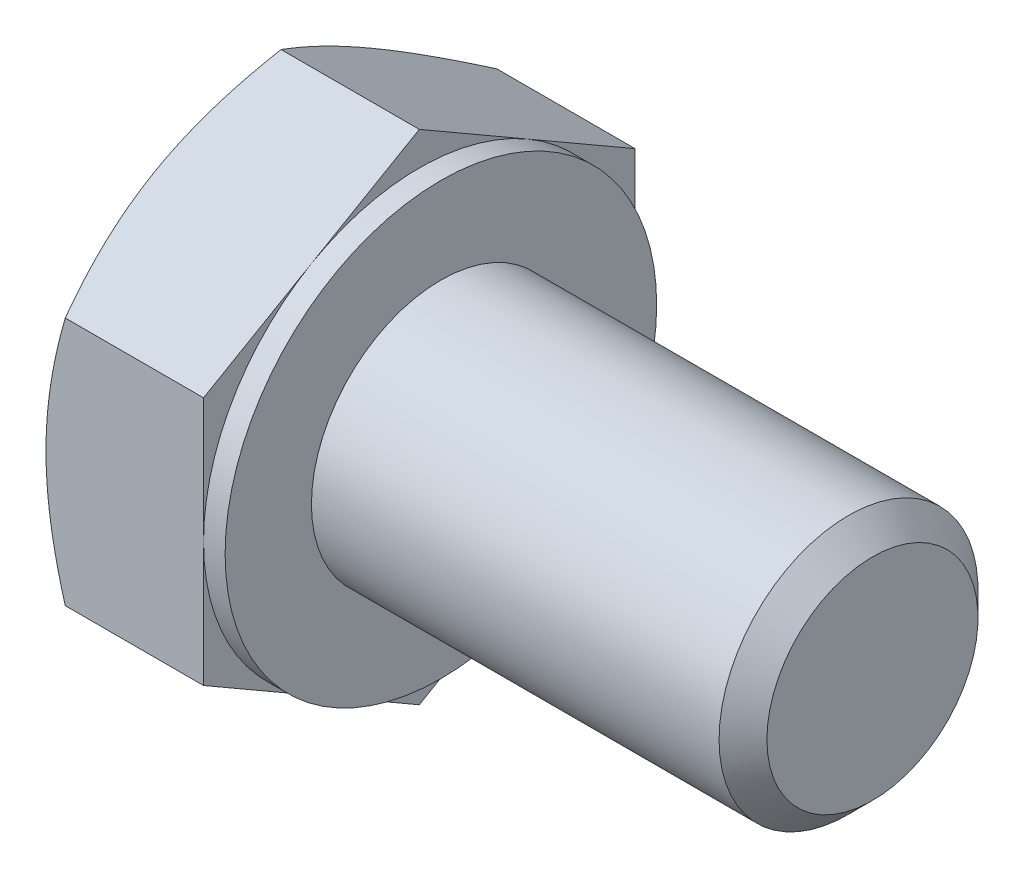
ISO-10303-21;
HEADER;
FILE_DESCRIPTION(('STEP AP214'),'2;1');
FILE_NAME('part.step','',(''),(''),'','','');
FILE_SCHEMA(('AUTOMOTIVE_DESIGN { 1 0 10303 214 1 1 1 1 }'));
ENDSEC;
DATA;
#1=APPLICATION_CONTEXT('core data for automotive mechanical design processes');
#2=APPLICATION_PROTOCOL_DEFINITION('international standard','automotive_design',2000,#1);
#3=PRODUCT_CONTEXT('',#1,'mechanical');
#4=PRODUCT('Part','Part','',(#3));
#5=PRODUCT_RELATED_PRODUCT_CATEGORY('part','',(#4));
#6=PRODUCT_DEFINITION_FORMATION('','',#4);
#7=PRODUCT_DEFINITION_CONTEXT('part definition',#1,'design');
#8=PRODUCT_DEFINITION('design','',#6,#7);
#9=PRODUCT_DEFINITION_SHAPE('','',#8);
#10=(LENGTH_UNIT() NAMED_UNIT(*) SI_UNIT(.MILLI.,.METRE.));
#11=(NAMED_UNIT(*) PLANE_ANGLE_UNIT() SI_UNIT($,.RADIAN.));
#12=(NAMED_UNIT(*) SI_UNIT($,.STERADIAN.) SOLID_ANGLE_UNIT());
#13=UNCERTAINTY_MEASURE_WITH_UNIT(LENGTH_MEASURE(1.E-05),#10,'distance_accuracy_value','');
#14=(GEOMETRIC_REPRESENTATION_CONTEXT(3) GLOBAL_UNCERTAINTY_ASSIGNED_CONTEXT((#13)) GLOBAL_UNIT_ASSIGNED_CONTEXT((#10,
#11,#12)) REPRESENTATION_CONTEXT('',''));
#15=CARTESIAN_POINT('',(0.,0.,0.));
#16=DIRECTION('',(0.,0.,1.));
#17=DIRECTION('',(1.,0.,0.));
#18=AXIS2_PLACEMENT_3D('',#15,#16,#17);
#19=CARTESIAN_POINT('',(4.15,2.88675134594812,-5.));
#20=DIRECTION('',(0.,-0.866025403784438,0.500000000000001));
#21=DIRECTION('',(0.,-0.500000000000001,-0.866025403784438));
#22=AXIS2_PLACEMENT_3D('',#19,#20,#21);
#23=PLANE('',#22);
#24=DIRECTION('',(0.,0.500000000000001,0.866025403784438));
#25=VECTOR('',#24,1.);
#26=CARTESIAN_POINT('',(3.65,2.88675134594812,-5.));
#27=LINE('',#26,#25);
#28=CARTESIAN_POINT('',(3.65,2.88675134594812,-5.));
#29=VERTEX_POINT('',#28);
#30=CARTESIAN_POINT('',(3.65,4.33012701892219,-2.50000000000001));
#31=VERTEX_POINT('',#30);
#32=EDGE_CURVE('E166',#29,#31,#27,.T.);
#33=ORIENTED_EDGE('',*,*,#32,.F.);
#34=DIRECTION('',(-1.,0.,0.));
#35=VECTOR('',#34,1.);
#36=CARTESIAN_POINT('',(4.15,2.88675134594812,-5.));
#37=LINE('',#36,#35);
#38=CARTESIAN_POINT('',(0.446581987385201,2.88675134594812,-5.));
#39=VERTEX_POINT('',#38);
#40=EDGE_CURVE('E299',#29,#39,#37,.T.);
#41=ORIENTED_EDGE('',*,*,#40,.T.);
#42=CARTESIAN_POINT('',(0.446648656051831,5.7736181619501,0.000200000000000224));
#43=CARTESIAN_POINT('',(0.373386567637637,5.64675433465071,-0.219534594525185));
#44=CARTESIAN_POINT('',(0.306751321918094,5.5188054379059,-0.44114858445958));
#45=CARTESIAN_POINT('',(0.190438991010812,5.26069210252318,-0.888213995453513));
#46=CARTESIAN_POINT('',(0.14080304991579,5.13052307794721,-1.11367335959077));
#47=CARTESIAN_POINT('',(0.0635510254186988,4.87177839004641,-1.56183230522351));
#48=CARTESIAN_POINT('',(0.0354203782834898,4.74324302208387,-1.78446209310419));
#49=CARTESIAN_POINT('',(0.0101949219536846,4.54998783160116,-2.11918990184664));
#50=CARTESIAN_POINT('',(0.004613459769484,4.48552534905128,-2.23084219680506));
#51=CARTESIAN_POINT('',(-0.000797783248529662,4.35654081066911,-2.4542499706738));
#52=CARTESIAN_POINT('',(-0.000627741741796364,4.2920187567385,-2.56600544629031));
#53=CARTESIAN_POINT('',(0.00775363179203674,4.11524635305244,-2.87218423085064));
#54=CARTESIAN_POINT('',(0.0218297718972513,4.00305457769146,-3.06650608596721));
#55=CARTESIAN_POINT('',(0.0664652571094302,3.77941563226457,-3.45386010199771));
#56=CARTESIAN_POINT('',(0.0970398601475075,3.66796924828418,-3.64689090137157));
#57=CARTESIAN_POINT('',(0.173468493621163,3.44387972423143,-4.03502534247485));
#58=CARTESIAN_POINT('',(0.219646378878679,3.3312648659868,-4.23007999864174));
#59=CARTESIAN_POINT('',(0.324451794491933,3.1077146415794,-4.61728034535877));
#60=CARTESIAN_POINT('',(0.383054703437373,2.99677641204846,-4.80943099540809));
#61=CARTESIAN_POINT('',(0.446648656051827,2.88663587589429,-5.0002));
#62=B_SPLINE_CURVE_WITH_KNOTS('',3,(#42,#43,#44,#45,#46,#47,#48,#49,#50,#51,#52,#53,#54,#55,#56,
#57,#58,#59,#60,#61),.UNSPECIFIED.,.F.,.F.,(4,2,2,2,2,2,2,2,2,4),(0.,0.792555841363091,
1.58701660053334,2.36181537487281,2.74884076077326,3.13585419177295,3.8096236259968,
4.4840172390119,5.17336882348929,5.86136694793726),.UNSPECIFIED.);
#63=CARTESIAN_POINT('',(0.,4.33012701892219,-2.50000000000001));
#64=VERTEX_POINT('',#63);
#65=EDGE_CURVE('E220',#64,#39,#62,.T.);
#66=ORIENTED_EDGE('',*,*,#65,.F.);
#67=CARTESIAN_POINT('',(0.446581987385204,5.77350269189626,0.));
#68=VERTEX_POINT('',#67);
#69=EDGE_CURVE('E57',#68,#64,#62,.T.);
#70=ORIENTED_EDGE('',*,*,#69,.F.);
#71=DIRECTION('',(-1.,0.,0.));
#72=VECTOR('',#71,1.);
#73=CARTESIAN_POINT('',(4.15,5.77350269189626,0.));
#74=LINE('',#73,#72);
#75=CARTESIAN_POINT('',(3.65,5.77350269189626,0.));
#76=VERTEX_POINT('',#75);
#77=EDGE_CURVE('E249',#76,#68,#74,.T.);
#78=ORIENTED_EDGE('',*,*,#77,.F.);
#79=EDGE_CURVE('E164',#31,#76,#27,.T.);
#80=ORIENTED_EDGE('',*,*,#79,.F.);
#81=EDGE_LOOP('',(#33,#41,#66,#70,#78,#80));
#82=FACE_BOUND('',#81,.T.);
#83=ADVANCED_FACE('F34',(#82),#23,.F.);
#84=CARTESIAN_POINT('',(4.15,5.77350269189626,0.));
#85=DIRECTION('',(0.,-0.866025403784438,-0.500000000000001));
#86=DIRECTION('',(0.,0.500000000000001,-0.866025403784438));
#87=AXIS2_PLACEMENT_3D('',#84,#85,#86);
#88=PLANE('',#87);
#89=DIRECTION('',(0.,-0.500000000000001,0.866025403784438));
#90=VECTOR('',#89,1.);
#91=CARTESIAN_POINT('',(3.65,5.77350269189626,0.));
#92=LINE('',#91,#90);
#93=CARTESIAN_POINT('',(3.65,4.33012701892219,2.50000000000001));
#94=VERTEX_POINT('',#93);
#95=EDGE_CURVE('E163',#76,#94,#92,.T.);
#96=ORIENTED_EDGE('',*,*,#95,.F.);
#97=ORIENTED_EDGE('',*,*,#77,.T.);
#98=CARTESIAN_POINT('',(0.446648656051827,2.88663587589429,5.0002));
#99=CARTESIAN_POINT('',(0.373386567637633,3.01349970319368,4.78046540547481));
#100=CARTESIAN_POINT('',(0.306751321918091,3.14144859993849,4.55885141554042));
#101=CARTESIAN_POINT('',(0.19043899101081,3.39956193532121,4.11178600454649));
#102=CARTESIAN_POINT('',(0.140803049915788,3.52973095989718,3.88632664040923));
#103=CARTESIAN_POINT('',(0.0635510254186978,3.78847564779797,3.43816769477649));
#104=CARTESIAN_POINT('',(0.0354203782834893,3.91701101576052,3.21553790689581));
#105=CARTESIAN_POINT('',(0.0101949219536845,4.11026620624322,2.88081009815336));
#106=CARTESIAN_POINT('',(0.00461345976948393,4.17472868879311,2.76915780319494));
#107=CARTESIAN_POINT('',(-0.000797783248529345,4.30371322717528,2.5457500293262));
#108=CARTESIAN_POINT('',(-0.000627741741795717,4.36823528110589,2.43399455370969));
#109=CARTESIAN_POINT('',(0.00775363179203802,4.54500768479194,2.12781576914936));
#110=CARTESIAN_POINT('',(0.0218297718972527,4.65719946015293,1.93349391403279));
#111=CARTESIAN_POINT('',(0.0664652571094319,4.88083840557981,1.54613989800229));
#112=CARTESIAN_POINT('',(0.0970398601475094,4.9922847895602,1.35310909862843));
#113=CARTESIAN_POINT('',(0.173468493621166,5.21637431361295,0.964974657525146));
#114=CARTESIAN_POINT('',(0.219646378878682,5.32898917185759,0.769920001358264));
#115=CARTESIAN_POINT('',(0.324451794491937,5.55253939626499,0.382719654641232));
#116=CARTESIAN_POINT('',(0.383054703437377,5.66347762579592,0.190569004591914));
#117=CARTESIAN_POINT('',(0.446648656051831,5.7736181619501,-0.000199999999999879));
#118=B_SPLINE_CURVE_WITH_KNOTS('',3,(#98,#99,#100,#101,#102,#103,#104,#105,#106,#107,#108,#109,
#110,#111,#112,#113,#114,#115,#116,#117),.UNSPECIFIED.,.F.,.F.,(4,2,2,2,2,2,2,2,2,4),(0.,
0.792555841363091,1.58701660053333,2.3618153748728,2.74884076077325,3.13585419177295,
3.80962362599679,4.48401723901189,5.17336882348929,5.86136694793725),.UNSPECIFIED.);
#119=CARTESIAN_POINT('',(0.,4.33012701892219,2.50000000000001));
#120=VERTEX_POINT('',#119);
#121=EDGE_CURVE('E217',#120,#68,#118,.T.);
#122=ORIENTED_EDGE('',*,*,#121,.F.);
#123=CARTESIAN_POINT('',(0.4465819873852,2.88675134594813,5.));
#124=VERTEX_POINT('',#123);
#125=EDGE_CURVE('E230',#124,#120,#118,.T.);
#126=ORIENTED_EDGE('',*,*,#125,.F.);
#127=DIRECTION('',(-1.,0.,0.));
#128=VECTOR('',#127,1.);
#129=CARTESIAN_POINT('',(4.15,2.88675134594813,5.));
#130=LINE('',#129,#128);
#131=CARTESIAN_POINT('',(3.65,2.88675134594813,5.));
#132=VERTEX_POINT('',#131);
#133=EDGE_CURVE('E255',#132,#124,#130,.T.);
#134=ORIENTED_EDGE('',*,*,#133,.F.);
#135=EDGE_CURVE('E131',#94,#132,#92,.T.);
#136=ORIENTED_EDGE('',*,*,#135,.F.);
#137=EDGE_LOOP('',(#96,#97,#122,#126,#134,#136));
#138=FACE_BOUND('',#137,.T.);
#139=ADVANCED_FACE('F237',(#138),#88,.F.);
#140=CARTESIAN_POINT('',(4.15,2.88675134594813,5.));
#141=DIRECTION('',(0.,0.,-1.));
#142=DIRECTION('',(-1.,0.,0.));
#143=AXIS2_PLACEMENT_3D('',#140,#141,#142);
#144=PLANE('',#143);
#145=DIRECTION('',(0.,-1.,0.));
#146=VECTOR('',#145,1.);
#147=CARTESIAN_POINT('',(3.65,2.88675134594813,5.));
#148=LINE('',#147,#146);
#149=CARTESIAN_POINT('',(3.65,0.,5.));
#150=VERTEX_POINT('',#149);
#151=EDGE_CURVE('E125',#132,#150,#148,.T.);
#152=ORIENTED_EDGE('',*,*,#151,.F.);
#153=ORIENTED_EDGE('',*,*,#133,.T.);
#154=CARTESIAN_POINT('',(2.47533544689295,-7.82661640313888,5.));
#155=CARTESIAN_POINT('',(2.36879683507772,-7.6075861302492,5.));
#156=CARTESIAN_POINT('',(2.26325911833055,-7.38806071364409,5.));
#157=CARTESIAN_POINT('',(2.0547470786595,-6.94775649535432,5.));
#158=CARTESIAN_POINT('',(1.95177314617002,-6.72697750897687,5.));
#159=CARTESIAN_POINT('',(1.74844778545274,-6.28280027125596,5.));
#160=CARTESIAN_POINT('',(1.64811306490868,-6.05939434592712,5.));
#161=CARTESIAN_POINT('',(1.45145486004311,-5.61083043832919,5.));
#162=CARTESIAN_POINT('',(1.35513119080617,-5.38567253739804,5.));
#163=CARTESIAN_POINT('',(1.1644503760596,-4.92576614780201,5.));
#164=CARTESIAN_POINT('',(1.07026351405995,-4.69094667859483,5.));
#165=CARTESIAN_POINT('',(0.888844387350833,-4.21858752735361,5.));
#166=CARTESIAN_POINT('',(0.801612892640655,-3.98104754746316,5.));
#167=CARTESIAN_POINT('',(0.636341071883236,-3.50329086404362,5.));
#168=CARTESIAN_POINT('',(0.558282765149707,-3.26308044250485,5.));
#169=CARTESIAN_POINT('',(0.413813856737661,-2.7792146781953,5.));
#170=CARTESIAN_POINT('',(0.347399663631971,-2.53556042275998,5.));
#171=CARTESIAN_POINT('',(0.229707450535048,-2.04600448312502,5.));
#172=CARTESIAN_POINT('',(0.178346573442476,-1.80012308686182,5.));
#173=CARTESIAN_POINT('',(0.0936230804935132,-1.30522837494364,5.));
#174=CARTESIAN_POINT('',(0.0602585789244905,-1.05621539022476,5.));
#175=CARTESIAN_POINT('',(0.0146229933804829,-0.559584253783057,5.));
#176=CARTESIAN_POINT('',(0.00207498506583983,-0.311992192967665,5.));
#177=CARTESIAN_POINT('',(-0.00159747165030545,0.183375584056747,5.));
#178=CARTESIAN_POINT('',(0.0072784944808627,0.43115130372665,5.));
#179=CARTESIAN_POINT('',(0.0397265053205847,0.849622860758236,5.));
#180=CARTESIAN_POINT('',(0.05798479126188,1.02075746544157,5.));
#181=CARTESIAN_POINT('',(0.103624049996723,1.3618139875752,5.));
#182=CARTESIAN_POINT('',(0.131006199082926,1.53173574577272,5.));
#183=CARTESIAN_POINT('',(0.225403333816324,2.03942834541588,5.));
#184=CARTESIAN_POINT('',(0.304653621104038,2.37495177168564,5.));
#185=CARTESIAN_POINT('',(0.442611792168642,2.87686006020153,5.));
#186=CARTESIAN_POINT('',(0.492453035928119,3.04583048582566,5.));
#187=CARTESIAN_POINT('',(0.597441969480144,3.3821306103866,5.));
#188=CARTESIAN_POINT('',(0.652589698776809,3.5494602970987,5.));
#189=CARTESIAN_POINT('',(0.7672957300064,3.88253122341818,5.));
#190=CARTESIAN_POINT('',(0.826852713137818,4.04827292137366,5.));
#191=CARTESIAN_POINT('',(0.949663499110055,4.37837269604185,5.));
#192=CARTESIAN_POINT('',(1.01291722636638,4.54273080096527,5.));
#193=CARTESIAN_POINT('',(1.18384085306906,4.9746759403977,5.));
#194=CARTESIAN_POINT('',(1.29410564783453,5.24123504256649,5.));
#195=CARTESIAN_POINT('',(1.52085041203993,5.77170603526335,5.));
#196=CARTESIAN_POINT('',(1.63733099805397,6.03561766007929,5.));
#197=CARTESIAN_POINT('',(1.87507624393349,6.56138078778338,5.));
#198=CARTESIAN_POINT('',(1.99634255328238,6.8232315423933,5.));
#199=CARTESIAN_POINT('',(2.24254703861693,7.34518395602016,5.));
#200=CARTESIAN_POINT('',(2.36748508200602,7.60528567778375,5.));
#201=CARTESIAN_POINT('',(2.62044102887898,8.12446478659923,5.));
#202=CARTESIAN_POINT('',(2.74846325062126,8.38354006552433,5.));
#203=CARTESIAN_POINT('',(3.00682668967549,8.90053291127541,5.));
#204=CARTESIAN_POINT('',(3.13716793074432,9.1584504662073,5.));
#205=CARTESIAN_POINT('',(3.53092424591317,9.93067662274979,5.));
#206=CARTESIAN_POINT('',(3.79712405172275,10.4435647238032,5.));
#207=CARTESIAN_POINT('',(4.30724046881171,11.4147548711532,5.));
#208=CARTESIAN_POINT('',(4.55067498762245,11.873311348306,5.));
#209=CARTESIAN_POINT('',(5.04052915785298,12.7888590468283,5.));
#210=CARTESIAN_POINT('',(5.28694897482743,13.2458501795696,5.));
#211=CARTESIAN_POINT('',(5.78122505346439,14.1571829390173,5.));
#212=CARTESIAN_POINT('',(6.02907430461244,14.6115283739736,5.));
#213=CARTESIAN_POINT('',(6.5264818551985,15.5192398746589,5.));
#214=CARTESIAN_POINT('',(6.77604002809906,15.9726060096992,5.));
#215=CARTESIAN_POINT('',(7.02622264559117,16.4256251044156,5.));
#216=B_SPLINE_CURVE_WITH_KNOTS('',3,(#154,#155,#156,#157,#158,#159,#160,#161,#162,#163,#164,
#165,#166,#167,#168,#169,#170,#171,#172,#173,#174,#175,#176,#177,#178,#179,#180,#181,#182,#183,
#184,#185,#186,#187,#188,#189,#190,#191,#192,#193,#194,#195,#196,#197,#198,#199,#200,#201,#202,
#203,#204,#205,#206,#207,#208,#209,#210,#211,#212,#213,#214,#215),.UNSPECIFIED.,.F.,.F.,(4,2,2,
2,2,2,2,2,2,2,2,2,2,2,2,2,2,2,2,2,2,2,2,2,2,2,2,2,2,2,4),(0.,0.730708682143097,1.4615279703375,
2.19620403652928,2.930846195478,3.68977491658213,4.44878753915767,5.20628666210827,
5.96355173484849,6.71656679485871,7.46950293642267,8.21233991237299,8.95519126159773,
9.47125991232469,9.98739512288341,11.0201893937443,11.5486465414698,12.0771076235976,
12.6054112774226,13.1337041332035,13.9989833719716,14.8643486020619,15.7300147459346,
16.5956496665091,17.4625765068272,18.3295122333794,20.0630293163822,21.6205191219182,
23.1780956996636,24.7307447704824,26.2832800921358),.UNSPECIFIED.);
#217=CARTESIAN_POINT('',(0.,0.,5.));
#218=VERTEX_POINT('',#217);
#219=EDGE_CURVE('E231',#218,#124,#216,.T.);
#220=ORIENTED_EDGE('',*,*,#219,.F.);
#221=CARTESIAN_POINT('',(0.446581987385196,-2.88675134594811,5.));
#222=VERTEX_POINT('',#221);
#223=EDGE_CURVE('E308',#222,#218,#216,.T.);
#224=ORIENTED_EDGE('',*,*,#223,.F.);
#225=DIRECTION('',(-1.,0.,0.));
#226=VECTOR('',#225,1.);
#227=CARTESIAN_POINT('',(4.15,-2.88675134594811,5.));
#228=LINE('',#227,#226);
#229=CARTESIAN_POINT('',(3.65,-2.88675134594811,5.));
#230=VERTEX_POINT('',#229);
#231=EDGE_CURVE('E157',#230,#222,#228,.T.);
#232=ORIENTED_EDGE('',*,*,#231,.F.);
#233=EDGE_CURVE('E135',#150,#230,#148,.T.);
#234=ORIENTED_EDGE('',*,*,#233,.F.);
#235=EDGE_LOOP('',(#152,#153,#220,#224,#232,#234));
#236=FACE_BOUND('',#235,.T.);
#237=ADVANCED_FACE('F155',(#236),#144,.F.);
#238=CARTESIAN_POINT('',(4.15,-5.77350269189626,0.));
#239=DIRECTION('',(0.,0.866025403784437,-0.500000000000002));
#240=DIRECTION('',(0.,0.500000000000002,0.866025403784438));
#241=AXIS2_PLACEMENT_3D('',#238,#239,#240);
#242=PLANE('',#241);
#243=DIRECTION('',(0.,-0.500000000000002,-0.866025403784438));
#244=VECTOR('',#243,1.);
#245=CARTESIAN_POINT('',(3.65,-5.77350269189626,0.));
#246=LINE('',#245,#244);
#247=CARTESIAN_POINT('',(3.65,-4.33012701892219,2.50000000000001));
#248=VERTEX_POINT('',#247);
#249=EDGE_CURVE('E142',#230,#248,#246,.T.);
#250=ORIENTED_EDGE('',*,*,#249,.F.);
#251=ORIENTED_EDGE('',*,*,#231,.T.);
#252=CARTESIAN_POINT('',(0.446648656051827,-5.77361816195009,-0.000200000000000053));
#253=CARTESIAN_POINT('',(0.373386567637633,-5.6467543346507,0.219534594525185));
#254=CARTESIAN_POINT('',(0.30675132191809,-5.51880543790589,0.441148584459579));
#255=CARTESIAN_POINT('',(0.190438991010808,-5.26069210252317,0.888213995453511));
#256=CARTESIAN_POINT('',(0.140803049915786,-5.1305230779472,1.11367335959077));
#257=CARTESIAN_POINT('',(0.0635510254186948,-4.87177839004641,1.56183230522351));
#258=CARTESIAN_POINT('',(0.0354203782834861,-4.74324302208386,1.78446209310419));
#259=CARTESIAN_POINT('',(0.0101949219536803,-4.54998783160116,2.11918990184664));
#260=CARTESIAN_POINT('',(0.00461345976947934,-4.48552534905127,2.23084219680506));
#261=CARTESIAN_POINT('',(-0.000797783248534773,-4.3565408106691,2.45424997067379));
#262=CARTESIAN_POINT('',(-0.000627741741801557,-4.29201875673849,2.56600544629031));
#263=CARTESIAN_POINT('',(0.0077536317920317,-4.11524635305243,2.87218423085063));
#264=CARTESIAN_POINT('',(0.0218297718972468,-4.00305457769145,3.06650608596721));
#265=CARTESIAN_POINT('',(0.0664652571094257,-3.77941563226456,3.4538601019977));
#266=CARTESIAN_POINT('',(0.0970398601475025,-3.66796924828417,3.64689090137157));
#267=CARTESIAN_POINT('',(0.173468493621158,-3.44387972423143,4.03502534247485));
#268=CARTESIAN_POINT('',(0.219646378878675,-3.33126486598679,4.23007999864173));
#269=CARTESIAN_POINT('',(0.324451794491929,-3.10771464157939,4.61728034535877));
#270=CARTESIAN_POINT('',(0.383054703437369,-2.99677641204845,4.80943099540809));
#271=CARTESIAN_POINT('',(0.446648656051823,-2.88663587589427,5.0002));
#272=B_SPLINE_CURVE_WITH_KNOTS('',3,(#252,#253,#254,#255,#256,#257,#258,#259,#260,#261,#262,
#263,#264,#265,#266,#267,#268,#269,#270,#271),.UNSPECIFIED.,.F.,.F.,(4,2,2,2,2,2,2,2,2,4),(0.,
0.79255584136309,1.58701660053333,2.3618153748728,2.74884076077325,3.13585419177295,
3.80962362599679,4.4840172390119,5.17336882348929,5.86136694793726),.UNSPECIFIED.);
#273=CARTESIAN_POINT('',(0.,-4.33012701892219,2.50000000000001));
#274=VERTEX_POINT('',#273);
#275=EDGE_CURVE('E219',#274,#222,#272,.T.);
#276=ORIENTED_EDGE('',*,*,#275,.F.);
#277=CARTESIAN_POINT('',(0.4465819873852,-5.77350269189625,0.));
#278=VERTEX_POINT('',#277);
#279=EDGE_CURVE('E211',#278,#274,#272,.T.);
#280=ORIENTED_EDGE('',*,*,#279,.F.);
#281=DIRECTION('',(-1.,0.,0.));
#282=VECTOR('',#281,1.);
#283=CARTESIAN_POINT('',(4.15,-5.77350269189626,0.));
#284=LINE('',#283,#282);
#285=CARTESIAN_POINT('',(3.65,-5.77350269189626,0.));
#286=VERTEX_POINT('',#285);
#287=EDGE_CURVE('E293',#286,#278,#284,.T.);
#288=ORIENTED_EDGE('',*,*,#287,.F.);
#289=EDGE_CURVE('E158',#248,#286,#246,.T.);
#290=ORIENTED_EDGE('',*,*,#289,.F.);
#291=EDGE_LOOP('',(#250,#251,#276,#280,#288,#290));
#292=FACE_BOUND('',#291,.T.);
#293=ADVANCED_FACE('F203',(#292),#242,.F.);
#294=CARTESIAN_POINT('',(4.15,-2.88675134594813,-5.));
#295=DIRECTION('',(0.,0.866025403784439,0.499999999999999));
#296=DIRECTION('',(0.,-0.499999999999999,0.866025403784439));
#297=AXIS2_PLACEMENT_3D('',#294,#295,#296);
#298=PLANE('',#297);
#299=DIRECTION('',(0.,0.499999999999999,-0.866025403784439));
#300=VECTOR('',#299,1.);
#301=CARTESIAN_POINT('',(3.65,-2.88675134594813,-5.));
#302=LINE('',#301,#300);
#303=CARTESIAN_POINT('',(3.65,-4.3301270189222,-2.5));
#304=VERTEX_POINT('',#303);
#305=EDGE_CURVE('E512',#286,#304,#302,.T.);
#306=ORIENTED_EDGE('',*,*,#305,.F.);
#307=ORIENTED_EDGE('',*,*,#287,.T.);
#308=CARTESIAN_POINT('',(0.446648656051831,-2.88663587589429,-5.0002));
#309=CARTESIAN_POINT('',(0.373386567637636,-3.01349970319368,-4.78046540547482));
#310=CARTESIAN_POINT('',(0.306751321918093,-3.14144859993849,-4.55885141554042));
#311=CARTESIAN_POINT('',(0.190438991010812,-3.39956193532121,-4.11178600454649));
#312=CARTESIAN_POINT('',(0.14080304991579,-3.52973095989718,-3.88632664040923));
#313=CARTESIAN_POINT('',(0.0635510254186991,-3.78847564779798,-3.43816769477649));
#314=CARTESIAN_POINT('',(0.0354203782834904,-3.91701101576052,-3.21553790689581));
#315=CARTESIAN_POINT('',(0.0101949219536853,-4.11026620624323,-2.88081009815336));
#316=CARTESIAN_POINT('',(0.00461345976948459,-4.17472868879311,-2.76915780319494));
#317=CARTESIAN_POINT('',(-0.000797783248529255,-4.30371322717528,-2.5457500293262));
#318=CARTESIAN_POINT('',(-0.000627741741796032,-4.36823528110589,-2.43399455370968));
#319=CARTESIAN_POINT('',(0.00775363179203717,-4.54500768479194,-2.12781576914936));
#320=CARTESIAN_POINT('',(0.0218297718972521,-4.65719946015293,-1.93349391403278));
#321=CARTESIAN_POINT('',(0.0664652571094311,-4.88083840557981,-1.54613989800229));
#322=CARTESIAN_POINT('',(0.0970398601475083,-4.9922847895602,-1.35310909862843));
#323=CARTESIAN_POINT('',(0.173468493621163,-5.21637431361295,-0.964974657525144));
#324=CARTESIAN_POINT('',(0.219646378878679,-5.32898917185759,-0.769920001358263));
#325=CARTESIAN_POINT('',(0.324451794491933,-5.55253939626498,-0.382719654641231));
#326=CARTESIAN_POINT('',(0.383054703437372,-5.66347762579591,-0.190569004591913));
#327=CARTESIAN_POINT('',(0.446648656051827,-5.77361816195009,0.000200000000000301));
#328=B_SPLINE_CURVE_WITH_KNOTS('',3,(#308,#309,#310,#311,#312,#313,#314,#315,#316,#317,#318,
#319,#320,#321,#322,#323,#324,#325,#326,#327),.UNSPECIFIED.,.F.,.F.,(4,2,2,2,2,2,2,2,2,4),(0.,
0.792555841363092,1.58701660053333,2.36181537487281,2.74884076077326,3.13585419177295,
3.80962362599679,4.48401723901189,5.17336882348928,5.86136694793725),.UNSPECIFIED.);
#329=CARTESIAN_POINT('',(0.,-4.3301270189222,-2.5));
#330=VERTEX_POINT('',#329);
#331=EDGE_CURVE('E218',#330,#278,#328,.T.);
#332=ORIENTED_EDGE('',*,*,#331,.F.);
#333=CARTESIAN_POINT('',(0.446581987384949,-2.88675134594852,-5.));
#334=VERTEX_POINT('',#333);
#335=EDGE_CURVE('E180',#334,#330,#328,.T.);
#336=ORIENTED_EDGE('',*,*,#335,.F.);
#337=DIRECTION('',(-1.,0.,0.));
#338=VECTOR('',#337,1.);
#339=CARTESIAN_POINT('',(4.15,-2.88675134594813,-5.));
#340=LINE('',#339,#338);
#341=CARTESIAN_POINT('',(3.65,-2.88675134594813,-5.));
#342=VERTEX_POINT('',#341);
#343=EDGE_CURVE('E300',#342,#334,#340,.T.);
#344=ORIENTED_EDGE('',*,*,#343,.F.);
#345=EDGE_CURVE('E153',#304,#342,#302,.T.);
#346=ORIENTED_EDGE('',*,*,#345,.F.);
#347=EDGE_LOOP('',(#306,#307,#332,#336,#344,#346));
#348=FACE_BOUND('',#347,.T.);
#349=ADVANCED_FACE('F196',(#348),#298,.F.);
#350=CARTESIAN_POINT('',(4.15,2.88675134594812,-5.));
#351=DIRECTION('',(0.,0.,1.));
#352=DIRECTION('',(0.,-1.,0.));
#353=AXIS2_PLACEMENT_3D('',#350,#351,#352);
#354=PLANE('',#353);
#355=DIRECTION('',(0.,1.,0.));
#356=VECTOR('',#355,1.);
#357=CARTESIAN_POINT('',(3.65,2.88675134594812,-5.));
#358=LINE('',#357,#356);
#359=CARTESIAN_POINT('',(3.65,0.,-5.));
#360=VERTEX_POINT('',#359);
#361=EDGE_CURVE('E11',#342,#360,#358,.T.);
#362=ORIENTED_EDGE('',*,*,#361,.F.);
#363=ORIENTED_EDGE('',*,*,#343,.T.);
#364=CARTESIAN_POINT('',(2.47533544773018,-7.82661640485967,-5.));
#365=CARTESIAN_POINT('',(2.36879683588001,-7.60758613191209,-5.));
#366=CARTESIAN_POINT('',(2.2632591190979,-7.38806071524903,-5.));
#367=CARTESIAN_POINT('',(2.05474707935716,-6.9477564968432,-5.));
#368=CARTESIAN_POINT('',(1.95177314683291,-6.72697751040762,-5.));
#369=CARTESIAN_POINT('',(1.74844778604609,-6.28280027256958,-5.));
#370=CARTESIAN_POINT('',(1.64811306546725,-6.05939434718172,-5.));
#371=CARTESIAN_POINT('',(1.4514548605327,-5.61083043946536,-5.));
#372=CARTESIAN_POINT('',(1.35513119126155,-5.38567253847479,-5.));
#373=CARTESIAN_POINT('',(1.16445037644562,-4.92576614875538,-5.));
#374=CARTESIAN_POINT('',(1.07026351441089,-4.69094667948418,-5.));
#375=CARTESIAN_POINT('',(0.888844387633474,-4.21858752811391,-5.));
#376=CARTESIAN_POINT('',(0.801612892890087,-3.98104754815841,-5.));
#377=CARTESIAN_POINT('',(0.636341072069425,-3.50329086460758,-5.));
#378=CARTESIAN_POINT('',(0.558282765305855,-3.26308044300257,-5.));
#379=CARTESIAN_POINT('',(0.41381385683863,-2.77921467855872,-5.));
#380=CARTESIAN_POINT('',(0.347399663707799,-2.53556042305535,-5.));
#381=CARTESIAN_POINT('',(0.229707450560149,-2.04600448324933,-5.));
#382=CARTESIAN_POINT('',(0.178346573443938,-1.80012308688265,-5.));
#383=CARTESIAN_POINT('',(0.0936230804633189,-1.305228374755,-5.));
#384=CARTESIAN_POINT('',(0.0602585788862659,-1.05621538993014,-5.));
#385=CARTESIAN_POINT('',(0.0146229933450854,-0.559584253278233,-5.));
#386=CARTESIAN_POINT('',(0.00207498504095148,-0.311992192358637,-5.));
#387=CARTESIAN_POINT('',(-0.001597471635994,0.183375584872587,-5.));
#388=CARTESIAN_POINT('',(0.00727849452386974,0.431151304645098,-5.));
#389=CARTESIAN_POINT('',(0.0397265054214777,0.84962286180559,-5.));
#390=CARTESIAN_POINT('',(0.0579847913857293,1.02075746651638,-5.));
#391=CARTESIAN_POINT('',(0.103624050167706,1.36181398870371,-5.));
#392=CARTESIAN_POINT('',(0.131006199278085,1.53173574692745,-5.));
#393=CARTESIAN_POINT('',(0.225403334084526,2.03942834664788,-5.));
#394=CARTESIAN_POINT('',(0.304653621421582,2.37495177296713,-5.));
#395=CARTESIAN_POINT('',(0.442611792559,2.87686006155704,-5.));
#396=CARTESIAN_POINT('',(0.492453036342917,3.04583048720638,-5.));
#397=CARTESIAN_POINT('',(0.597441969943077,3.38213061181744,-5.));
#398=CARTESIAN_POINT('',(0.652589699263439,3.54946029855447,-5.));
#399=CARTESIAN_POINT('',(0.767295730539578,3.88253122492361,-5.));
#400=CARTESIAN_POINT('',(0.826852713693847,4.04827292290383,-5.));
#401=CARTESIAN_POINT('',(0.949663499710994,4.3783726976215,-5.));
#402=CARTESIAN_POINT('',(1.01291722698938,4.54273080256967,-5.));
#403=CARTESIAN_POINT('',(1.18384085372923,4.97467594201676,-5.));
#404=CARTESIAN_POINT('',(1.29410564850765,5.24123504417613,-5.));
#405=CARTESIAN_POINT('',(1.5208504127353,5.77170603685537,-5.));
#406=CARTESIAN_POINT('',(1.63733099875865,6.03561766166309,-5.));
#407=CARTESIAN_POINT('',(1.87507624465413,6.56138078935161,-5.));
#408=CARTESIAN_POINT('',(1.99634255400967,6.82323154395418,-5.));
#409=CARTESIAN_POINT('',(2.24254703935561,7.34518395756714,-5.));
#410=CARTESIAN_POINT('',(2.36748508274945,7.60528567932417,-5.));
#411=CARTESIAN_POINT('',(2.62044102963033,8.12446478812675,-5.));
#412=CARTESIAN_POINT('',(2.74846325137577,8.38354006704552,-5.));
#413=CARTESIAN_POINT('',(3.00682669043527,8.9005329127844,-5.));
#414=CARTESIAN_POINT('',(3.1371679315062,9.15845046771043,-5.));
#415=CARTESIAN_POINT('',(3.53092424668022,9.93067662423604,-5.));
#416=CARTESIAN_POINT('',(3.79712405249168,10.443564725279,-5.));
#417=CARTESIAN_POINT('',(4.30724046958687,11.4147548726184,-5.));
#418=CARTESIAN_POINT('',(4.55067498840223,11.8733113497711,-5.));
#419=CARTESIAN_POINT('',(5.04052915864104,12.7888590482935,-5.));
#420=CARTESIAN_POINT('',(5.28694897561916,13.2458501810351,-5.));
#421=CARTESIAN_POINT('',(5.78122505426358,14.1571829404851,-5.));
#422=CARTESIAN_POINT('',(6.02907430541543,14.6115283754434,-5.));
#423=CARTESIAN_POINT('',(6.52648185600867,15.519239876133,-5.));
#424=CARTESIAN_POINT('',(6.77604002891261,15.9726060111756,-5.));
#425=CARTESIAN_POINT('',(7.02622264640795,16.4256251058943,-5.));
#426=B_SPLINE_CURVE_WITH_KNOTS('',3,(#364,#365,#366,#367,#368,#369,#370,#371,#372,#373,#374,
#375,#376,#377,#378,#379,#380,#381,#382,#383,#384,#385,#386,#387,#388,#389,#390,#391,#392,#393,
#394,#395,#396,#397,#398,#399,#400,#401,#402,#403,#404,#405,#406,#407,#408,#409,#410,#411,#412,
#413,#414,#415,#416,#417,#418,#419,#420,#421,#422,#423,#424,#425),.UNSPECIFIED.,.F.,.F.,(4,2,2,
2,2,2,2,2,2,2,2,2,2,2,2,2,2,2,2,2,2,2,2,2,2,2,2,2,2,2,4),(0.,0.730708682345172,1.46152797074168,
2.19620403713772,2.93084619629068,3.6897749176122,4.44878754040521,5.20628666357256,
5.96355173652936,6.7165667968573,7.46950293873851,8.21233991499824,8.95519126453256,
9.47125991534871,9.98739512599665,11.0201893970363,11.5486465448551,12.0771076270762,
12.6054112809942,13.1337041368682,13.9989833756252,14.8643486057043,15.7300147495654,
16.5956496701284,17.4625765104336,18.329512236973,20.0630293199505,21.6205191254926,
23.1780957032439,24.7307447740735,26.2832800957379),.UNSPECIFIED.);
#427=CARTESIAN_POINT('',(0.,0.,-5.));
#428=VERTEX_POINT('',#427);
#429=EDGE_CURVE('E170',#428,#334,#426,.F.);
#430=ORIENTED_EDGE('',*,*,#429,.F.);
#431=EDGE_CURVE('E179',#39,#428,#426,.F.);
#432=ORIENTED_EDGE('',*,*,#431,.F.);
#433=ORIENTED_EDGE('',*,*,#40,.F.);
#434=EDGE_CURVE('E38',#360,#29,#358,.T.);
#435=ORIENTED_EDGE('',*,*,#434,.F.);
#436=EDGE_LOOP('',(#362,#363,#430,#432,#433,#435));
#437=FACE_BOUND('',#436,.T.);
#438=ADVANCED_FACE('F191',(#437),#354,.F.);
#439=CARTESIAN_POINT('',(0.,0.,0.));
#440=DIRECTION('',(1.,0.,0.));
#441=DIRECTION('',(0.,0.,-1.));
#442=AXIS2_PLACEMENT_3D('',#439,#440,#441);
#443=CONICAL_SURFACE('',#442,5.,1.0471975511966);
#444=ORIENTED_EDGE('',*,*,#335,.T.);
#445=CARTESIAN_POINT('',(0.,0.,0.));
#446=DIRECTION('',(1.,0.,0.));
#447=DIRECTION('',(0.,0.,-1.));
#448=AXIS2_PLACEMENT_3D('',#445,#446,#447);
#449=CIRCLE('',#448,5.);
#450=EDGE_CURVE('E254',#330,#428,#449,.T.);
#451=ORIENTED_EDGE('',*,*,#450,.T.);
#452=ORIENTED_EDGE('',*,*,#429,.T.);
#453=EDGE_LOOP('',(#444,#451,#452));
#454=FACE_BOUND('',#453,.T.);
#455=ADVANCED_FACE('F195',(#454),#443,.T.);
#456=ORIENTED_EDGE('',*,*,#279,.T.);
#457=EDGE_CURVE('E258',#274,#330,#449,.T.);
#458=ORIENTED_EDGE('',*,*,#457,.T.);
#459=ORIENTED_EDGE('',*,*,#331,.T.);
#460=EDGE_LOOP('',(#456,#458,#459));
#461=FACE_BOUND('',#460,.T.);
#462=ADVANCED_FACE('F281',(#461),#443,.T.);
#463=ORIENTED_EDGE('',*,*,#223,.T.);
#464=EDGE_CURVE('E272',#218,#274,#449,.T.);
#465=ORIENTED_EDGE('',*,*,#464,.T.);
#466=ORIENTED_EDGE('',*,*,#275,.T.);
#467=EDGE_LOOP('',(#463,#465,#466));
#468=FACE_BOUND('',#467,.T.);
#469=ADVANCED_FACE('F187',(#468),#443,.T.);
#470=ORIENTED_EDGE('',*,*,#219,.T.);
#471=ORIENTED_EDGE('',*,*,#125,.T.);
#472=CARTESIAN_POINT('',(0.,0.,0.));
#473=DIRECTION('',(-1.,0.,0.));
#474=DIRECTION('',(0.,0.,1.));
#475=AXIS2_PLACEMENT_3D('',#472,#473,#474);
#476=CIRCLE('',#475,5.);
#477=EDGE_CURVE('E167',#218,#120,#476,.T.);
#478=ORIENTED_EDGE('',*,*,#477,.F.);
#479=EDGE_LOOP('',(#470,#471,#478));
#480=FACE_BOUND('',#479,.T.);
#481=ADVANCED_FACE('F318',(#480),#443,.T.);
#482=ORIENTED_EDGE('',*,*,#121,.T.);
#483=ORIENTED_EDGE('',*,*,#69,.T.);
#484=EDGE_CURVE('E267',#64,#120,#449,.T.);
#485=ORIENTED_EDGE('',*,*,#484,.T.);
#486=EDGE_LOOP('',(#482,#483,#485));
#487=FACE_BOUND('',#486,.T.);
#488=ADVANCED_FACE('F319',(#487),#443,.T.);
#489=ORIENTED_EDGE('',*,*,#65,.T.);
#490=ORIENTED_EDGE('',*,*,#431,.T.);
#491=EDGE_CURVE('E260',#428,#64,#449,.T.);
#492=ORIENTED_EDGE('',*,*,#491,.T.);
#493=EDGE_LOOP('',(#489,#490,#492));
#494=FACE_BOUND('',#493,.T.);
#495=ADVANCED_FACE('F295',(#494),#443,.T.);
#496=CARTESIAN_POINT('',(0.51875,0.192376607408562,0.0332122445882987));
#497=DIRECTION('',(-1.,0.,0.));
#498=DIRECTION('',(0.,0.,1.));
#499=AXIS2_PLACEMENT_3D('',#496,#497,#498);
#500=PLANE('',#499);
#501=CARTESIAN_POINT('',(0.51875,0.192376607408562,0.0332122445882987));
#502=DIRECTION('',(-1.,0.,0.));
#503=DIRECTION('',(0.,0.,1.));
#504=AXIS2_PLACEMENT_3D('',#501,#502,#503);
#505=CIRCLE('',#504,4.375);
#506=CARTESIAN_POINT('',(0.51875,0.192376607408562,4.4082122445883));
#507=VERTEX_POINT('',#506);
#508=EDGE_CURVE('E314',#507,#507,#505,.T.);
#509=ORIENTED_EDGE('',*,*,#508,.T.);
#510=EDGE_LOOP('',(#509));
#511=FACE_BOUND('',#510,.T.);
#512=ADVANCED_FACE('F325',(#511),#500,.T.);
#513=CARTESIAN_POINT('',(0.51875,0.192376607408562,0.0332122445882987));
#514=DIRECTION('',(-1.,0.,0.));
#515=DIRECTION('',(0.,0.,1.));
#516=AXIS2_PLACEMENT_3D('',#513,#514,#515);
#517=CYLINDRICAL_SURFACE('',#516,4.375);
#518=CARTESIAN_POINT('',(0.,0.192376607408562,0.0332122445882987));
#519=DIRECTION('',(-1.,0.,0.));
#520=DIRECTION('',(0.,0.,1.));
#521=AXIS2_PLACEMENT_3D('',#518,#519,#520);
#522=CIRCLE('',#521,4.375);
#523=CARTESIAN_POINT('',(0.,0.192376607408562,4.4082122445883));
#524=VERTEX_POINT('',#523);
#525=EDGE_CURVE('E312',#524,#524,#522,.T.);
#526=CARTESIAN_POINT('',(0.51875,0.192376607408562,4.4082122445883));
#527=CARTESIAN_POINT('',(0.513346354166667,0.192376607408562,4.4082122445883));
#528=CARTESIAN_POINT('',(0.507942708333333,0.192376607408562,4.4082122445883));
#529=CARTESIAN_POINT('',(0.497135416666667,0.192376607408562,4.4082122445883));
#530=CARTESIAN_POINT('',(0.491731770833333,0.192376607408562,4.4082122445883));
#531=CARTESIAN_POINT('',(0.480924479166667,0.192376607408562,4.4082122445883));
#532=CARTESIAN_POINT('',(0.475520833333333,0.192376607408562,4.4082122445883));
#533=CARTESIAN_POINT('',(0.464713541666667,0.192376607408562,4.4082122445883));
#534=CARTESIAN_POINT('',(0.459309895833333,0.192376607408562,4.4082122445883));
#535=CARTESIAN_POINT('',(0.448502604166667,0.192376607408562,4.4082122445883));
#536=CARTESIAN_POINT('',(0.443098958333333,0.192376607408562,4.4082122445883));
#537=CARTESIAN_POINT('',(0.432291666666667,0.192376607408562,4.4082122445883));
#538=CARTESIAN_POINT('',(0.426888020833333,0.192376607408562,4.4082122445883));
#539=CARTESIAN_POINT('',(0.416080729166667,0.192376607408562,4.4082122445883));
#540=CARTESIAN_POINT('',(0.410677083333333,0.192376607408562,4.4082122445883));
#541=CARTESIAN_POINT('',(0.399869791666667,0.192376607408562,4.4082122445883));
#542=CARTESIAN_POINT('',(0.394466145833333,0.192376607408562,4.4082122445883));
#543=CARTESIAN_POINT('',(0.383658854166667,0.192376607408562,4.4082122445883));
#544=CARTESIAN_POINT('',(0.378255208333333,0.192376607408562,4.4082122445883));
#545=CARTESIAN_POINT('',(0.367447916666667,0.192376607408562,4.4082122445883));
#546=CARTESIAN_POINT('',(0.362044270833333,0.192376607408562,4.4082122445883));
#547=CARTESIAN_POINT('',(0.351236979166667,0.192376607408562,4.4082122445883));
#548=CARTESIAN_POINT('',(0.345833333333333,0.192376607408562,4.4082122445883));
#549=CARTESIAN_POINT('',(0.335026041666667,0.192376607408562,4.4082122445883));
#550=CARTESIAN_POINT('',(0.329622395833333,0.192376607408562,4.4082122445883));
#551=CARTESIAN_POINT('',(0.318815104166667,0.192376607408562,4.4082122445883));
#552=CARTESIAN_POINT('',(0.313411458333333,0.192376607408562,4.4082122445883));
#553=CARTESIAN_POINT('',(0.302604166666667,0.192376607408562,4.4082122445883));
#554=CARTESIAN_POINT('',(0.297200520833333,0.192376607408562,4.4082122445883));
#555=CARTESIAN_POINT('',(0.286393229166667,0.192376607408562,4.4082122445883));
#556=CARTESIAN_POINT('',(0.280989583333333,0.192376607408562,4.4082122445883));
#557=CARTESIAN_POINT('',(0.270182291666667,0.192376607408562,4.4082122445883));
#558=CARTESIAN_POINT('',(0.264778645833333,0.192376607408562,4.4082122445883));
#559=CARTESIAN_POINT('',(0.253971354166667,0.192376607408562,4.4082122445883));
#560=CARTESIAN_POINT('',(0.248567708333333,0.192376607408562,4.4082122445883));
#561=CARTESIAN_POINT('',(0.237760416666667,0.192376607408562,4.4082122445883));
#562=CARTESIAN_POINT('',(0.232356770833333,0.192376607408562,4.4082122445883));
#563=CARTESIAN_POINT('',(0.221549479166667,0.192376607408562,4.4082122445883));
#564=CARTESIAN_POINT('',(0.216145833333333,0.192376607408562,4.4082122445883));
#565=CARTESIAN_POINT('',(0.205338541666667,0.192376607408562,4.4082122445883));
#566=CARTESIAN_POINT('',(0.199934895833333,0.192376607408562,4.4082122445883));
#567=CARTESIAN_POINT('',(0.189127604166667,0.192376607408562,4.4082122445883));
#568=CARTESIAN_POINT('',(0.183723958333333,0.192376607408562,4.4082122445883));
#569=CARTESIAN_POINT('',(0.172916666666667,0.192376607408562,4.4082122445883));
#570=CARTESIAN_POINT('',(0.167513020833333,0.192376607408562,4.4082122445883));
#571=CARTESIAN_POINT('',(0.156705729166667,0.192376607408562,4.4082122445883));
#572=CARTESIAN_POINT('',(0.151302083333333,0.192376607408562,4.4082122445883));
#573=CARTESIAN_POINT('',(0.140494791666667,0.192376607408562,4.4082122445883));
#574=CARTESIAN_POINT('',(0.135091145833333,0.192376607408562,4.4082122445883));
#575=CARTESIAN_POINT('',(0.124283854166667,0.192376607408562,4.4082122445883));
#576=CARTESIAN_POINT('',(0.118880208333333,0.192376607408562,4.4082122445883));
#577=CARTESIAN_POINT('',(0.108072916666667,0.192376607408562,4.4082122445883));
#578=CARTESIAN_POINT('',(0.102669270833333,0.192376607408562,4.4082122445883));
#579=CARTESIAN_POINT('',(0.0918619791666667,0.192376607408562,4.4082122445883));
#580=CARTESIAN_POINT('',(0.0864583333333334,0.192376607408562,4.4082122445883));
#581=CARTESIAN_POINT('',(0.0756510416666667,0.192376607408562,4.4082122445883));
#582=CARTESIAN_POINT('',(0.0702473958333334,0.192376607408562,4.4082122445883));
#583=CARTESIAN_POINT('',(0.0594401041666667,0.192376607408562,4.4082122445883));
#584=CARTESIAN_POINT('',(0.0540364583333333,0.192376607408562,4.4082122445883));
#585=CARTESIAN_POINT('',(0.0432291666666667,0.192376607408562,4.4082122445883));
#586=CARTESIAN_POINT('',(0.0378255208333333,0.192376607408562,4.4082122445883));
#587=CARTESIAN_POINT('',(0.0270182291666667,0.192376607408562,4.4082122445883));
#588=CARTESIAN_POINT('',(0.0216145833333333,0.192376607408562,4.4082122445883));
#589=CARTESIAN_POINT('',(0.0108072916666666,0.192376607408562,4.4082122445883));
#590=CARTESIAN_POINT('',(0.00540364583333331,0.192376607408562,4.4082122445883));
#591=CARTESIAN_POINT('',(0.,0.192376607408562,4.4082122445883));
#592=B_SPLINE_CURVE_WITH_KNOTS('',3,(#526,#527,#528,#529,#530,#531,#532,#533,#534,#535,#536,
#537,#538,#539,#540,#541,#542,#543,#544,#545,#546,#547,#548,#549,#550,#551,#552,#553,#554,#555,
#556,#557,#558,#559,#560,#561,#562,#563,#564,#565,#566,#567,#568,#569,#570,#571,#572,#573,#574,
#575,#576,#577,#578,#579,#580,#581,#582,#583,#584,#585,#586,#587,#588,#589,#590,#591),
.UNSPECIFIED.,.F.,.F.,(4,2,2,2,2,2,2,2,2,2,2,2,2,2,2,2,2,2,2,2,2,2,2,2,2,2,2,2,2,2,2,2,4),(0.,
0.0162109374999999,0.032421875,0.0486328125,0.06484375,0.0810546875,0.097265625,0.1134765625,
0.1296875,0.1458984375,0.162109375,0.1783203125,0.19453125,0.2107421875,0.226953125,
0.2431640625,0.259375,0.2755859375,0.291796875,0.3080078125,0.32421875,0.3404296875,0.356640625,
0.3728515625,0.3890625,0.4052734375,0.421484375,0.4376953125,0.45390625,0.4701171875,
0.486328125,0.5025390625,0.51875),.UNSPECIFIED.);
#593=EDGE_CURVE('BSEAM372',#507,#524,#592,.T.);
#594=ORIENTED_EDGE('',*,*,#508,.F.);
#595=ORIENTED_EDGE('',*,*,#525,.T.);
#596=ORIENTED_EDGE('',*,*,#593,.T.);
#597=ORIENTED_EDGE('',*,*,#593,.F.);
#598=EDGE_LOOP('',(#594,#596,#595,#597));
#599=FACE_BOUND('',#598,.T.);
#600=ADVANCED_FACE('F372',(#599),#517,.F.);
#601=CARTESIAN_POINT('',(0.,5.77350269189626,0.));
#602=DIRECTION('',(1.,0.,0.));
#603=DIRECTION('',(0.,0.,-1.));
#604=AXIS2_PLACEMENT_3D('',#601,#602,#603);
#605=PLANE('',#604);
#606=ORIENTED_EDGE('',*,*,#525,.F.);
#607=EDGE_LOOP('',(#606));
#608=FACE_BOUND('',#607,.T.);
#609=ORIENTED_EDGE('',*,*,#491,.F.);
#610=ORIENTED_EDGE('',*,*,#450,.F.);
#611=ORIENTED_EDGE('',*,*,#457,.F.);
#612=ORIENTED_EDGE('',*,*,#464,.F.);
#613=ORIENTED_EDGE('',*,*,#477,.T.);
#614=ORIENTED_EDGE('',*,*,#484,.F.);
#615=EDGE_LOOP('',(#609,#610,#611,#612,#613,#614));
#616=FACE_BOUND('',#615,.T.);
#617=ADVANCED_FACE('F198',(#608,#616),#605,.F.);
#618=CARTESIAN_POINT('',(3.65,5.,0.));
#619=DIRECTION('',(1.,0.,0.));
#620=DIRECTION('',(0.,0.,-1.));
#621=AXIS2_PLACEMENT_3D('',#618,#619,#620);
#622=PLANE('',#621);
#623=ORIENTED_EDGE('',*,*,#32,.T.);
#624=CARTESIAN_POINT('',(3.65,0.,0.));
#625=DIRECTION('',(-1.,0.,0.));
#626=DIRECTION('',(0.,0.,1.));
#627=AXIS2_PLACEMENT_3D('',#624,#625,#626);
#628=CIRCLE('',#627,5.);
#629=EDGE_CURVE('E49',#31,#360,#628,.T.);
#630=ORIENTED_EDGE('',*,*,#629,.T.);
#631=ORIENTED_EDGE('',*,*,#434,.T.);
#632=EDGE_LOOP('',(#623,#630,#631));
#633=FACE_BOUND('',#632,.T.);
#634=ADVANCED_FACE('F371',(#633),#622,.T.);
#635=ORIENTED_EDGE('',*,*,#79,.T.);
#636=ORIENTED_EDGE('',*,*,#95,.T.);
#637=EDGE_CURVE('E152',#94,#31,#628,.T.);
#638=ORIENTED_EDGE('',*,*,#637,.T.);
#639=EDGE_LOOP('',(#635,#636,#638));
#640=FACE_BOUND('',#639,.T.);
#641=ADVANCED_FACE('F496',(#640),#622,.T.);
#642=ORIENTED_EDGE('',*,*,#135,.T.);
#643=ORIENTED_EDGE('',*,*,#151,.T.);
#644=EDGE_CURVE('E129',#150,#94,#628,.T.);
#645=ORIENTED_EDGE('',*,*,#644,.T.);
#646=EDGE_LOOP('',(#642,#643,#645));
#647=FACE_BOUND('',#646,.T.);
#648=ADVANCED_FACE('F127',(#647),#622,.T.);
#649=ORIENTED_EDGE('',*,*,#233,.T.);
#650=ORIENTED_EDGE('',*,*,#249,.T.);
#651=EDGE_CURVE('E139',#248,#150,#628,.T.);
#652=ORIENTED_EDGE('',*,*,#651,.T.);
#653=EDGE_LOOP('',(#649,#650,#652));
#654=FACE_BOUND('',#653,.T.);
#655=ADVANCED_FACE('F140',(#654),#622,.T.);
#656=ORIENTED_EDGE('',*,*,#289,.T.);
#657=ORIENTED_EDGE('',*,*,#305,.T.);
#658=EDGE_CURVE('E146',#304,#248,#628,.T.);
#659=ORIENTED_EDGE('',*,*,#658,.T.);
#660=EDGE_LOOP('',(#656,#657,#659));
#661=FACE_BOUND('',#660,.T.);
#662=ADVANCED_FACE('F472',(#661),#622,.T.);
#663=ORIENTED_EDGE('',*,*,#345,.T.);
#664=ORIENTED_EDGE('',*,*,#361,.T.);
#665=EDGE_CURVE('E511',#360,#304,#628,.T.);
#666=ORIENTED_EDGE('',*,*,#665,.T.);
#667=EDGE_LOOP('',(#663,#664,#666));
#668=FACE_BOUND('',#667,.T.);
#669=ADVANCED_FACE('F463',(#668),#622,.T.);
#670=CARTESIAN_POINT('',(0.,0.,0.));
#671=DIRECTION('',(-1.,0.,0.));
#672=DIRECTION('',(0.,0.,1.));
#673=AXIS2_PLACEMENT_3D('',#670,#671,#672);
#674=CYLINDRICAL_SURFACE('',#673,5.);
#675=ORIENTED_EDGE('',*,*,#629,.F.);
#676=ORIENTED_EDGE('',*,*,#637,.F.);
#677=ORIENTED_EDGE('',*,*,#644,.F.);
#678=ORIENTED_EDGE('',*,*,#651,.F.);
#679=ORIENTED_EDGE('',*,*,#658,.F.);
#680=ORIENTED_EDGE('',*,*,#665,.F.);
#681=EDGE_LOOP('',(#675,#676,#677,#678,#679,#680));
#682=FACE_BOUND('',#681,.T.);
#683=CARTESIAN_POINT('',(4.15,0.,0.));
#684=DIRECTION('',(1.,0.,0.));
#685=DIRECTION('',(0.,0.,-1.));
#686=AXIS2_PLACEMENT_3D('',#683,#684,#685);
#687=CIRCLE('',#686,5.);
#688=CARTESIAN_POINT('',(4.15,0.,-5.));
#689=VERTEX_POINT('',#688);
#690=EDGE_CURVE('E263',#689,#689,#687,.T.);
#691=ORIENTED_EDGE('',*,*,#690,.F.);
#692=EDGE_LOOP('',(#691));
#693=FACE_BOUND('',#692,.T.);
#694=ADVANCED_FACE('F149',(#682,#693),#674,.T.);
#695=CARTESIAN_POINT('',(14.15,0.,0.));
#696=DIRECTION('',(-1.,0.,0.));
#697=DIRECTION('',(0.,0.,1.));
#698=AXIS2_PLACEMENT_3D('',#695,#696,#697);
#699=PLANE('',#698);
#700=CARTESIAN_POINT('',(14.15,0.,0.));
#701=DIRECTION('',(-1.,0.,0.));
#702=DIRECTION('',(0.,0.,1.));
#703=AXIS2_PLACEMENT_3D('',#700,#701,#702);
#704=CIRCLE('',#703,2.4455);
#705=CARTESIAN_POINT('',(14.15,0.,2.4455));
#706=VERTEX_POINT('',#705);
#707=EDGE_CURVE('E523',#706,#706,#704,.T.);
#708=ORIENTED_EDGE('',*,*,#707,.F.);
#709=EDGE_LOOP('',(#708));
#710=FACE_BOUND('',#709,.T.);
#711=ADVANCED_FACE('F422',(#710),#699,.F.);
#712=CARTESIAN_POINT('',(14.15,0.,0.));
#713=DIRECTION('',(-1.,0.,0.));
#714=DIRECTION('',(0.,0.,1.));
#715=AXIS2_PLACEMENT_3D('',#712,#713,#714);
#716=CONICAL_SURFACE('',#715,2.4455,0.785398163397441);
#717=CARTESIAN_POINT('',(13.5955,0.,0.));
#718=DIRECTION('',(-1.,0.,0.));
#719=DIRECTION('',(0.,0.,1.));
#720=AXIS2_PLACEMENT_3D('',#717,#718,#719);
#721=CIRCLE('',#720,3.);
#722=CARTESIAN_POINT('',(13.5955,0.,3.));
#723=VERTEX_POINT('',#722);
#724=EDGE_CURVE('E521',#723,#723,#721,.T.);
#725=ORIENTED_EDGE('',*,*,#724,.F.);
#726=EDGE_LOOP('',(#725));
#727=FACE_BOUND('',#726,.T.);
#728=ORIENTED_EDGE('',*,*,#707,.T.);
#729=EDGE_LOOP('',(#728));
#730=FACE_BOUND('',#729,.T.);
#731=ADVANCED_FACE('F426',(#727,#730),#716,.T.);
#732=CARTESIAN_POINT('',(0.,0.,0.));
#733=DIRECTION('',(-1.,0.,0.));
#734=DIRECTION('',(0.,0.,1.));
#735=AXIS2_PLACEMENT_3D('',#732,#733,#734);
#736=CYLINDRICAL_SURFACE('',#735,3.);
#737=CARTESIAN_POINT('',(4.15,0.,0.));
#738=DIRECTION('',(1.,0.,0.));
#739=DIRECTION('',(0.,0.,-1.));
#740=AXIS2_PLACEMENT_3D('',#737,#738,#739);
#741=CIRCLE('',#740,3.);
#742=CARTESIAN_POINT('',(4.15,0.,-3.));
#743=VERTEX_POINT('',#742);
#744=EDGE_CURVE('E304',#743,#743,#741,.F.);
#745=ORIENTED_EDGE('',*,*,#744,.F.);
#746=EDGE_LOOP('',(#745));
#747=FACE_BOUND('',#746,.T.);
#748=ORIENTED_EDGE('',*,*,#724,.T.);
#749=EDGE_LOOP('',(#748));
#750=FACE_BOUND('',#749,.T.);
#751=ADVANCED_FACE('F437',(#747,#750),#736,.T.);
#752=CARTESIAN_POINT('',(4.15,5.77350269189626,0.));
#753=DIRECTION('',(1.,0.,0.));
#754=DIRECTION('',(0.,0.,-1.));
#755=AXIS2_PLACEMENT_3D('',#752,#753,#754);
#756=PLANE('',#755);
#757=ORIENTED_EDGE('',*,*,#744,.T.);
#758=EDGE_LOOP('',(#757));
#759=FACE_BOUND('',#758,.T.);
#760=ORIENTED_EDGE('',*,*,#690,.T.);
#761=EDGE_LOOP('',(#760));
#762=FACE_BOUND('',#761,.T.);
#763=ADVANCED_FACE('F446',(#759,#762),#756,.T.);
#764=CLOSED_SHELL('',(#83,#139,#237,#293,#349,#438,#455,#462,#469,#481,#488,#495,#512,#600,#617,
#634,#641,#648,#655,#662,#669,#694,#711,#731,#751,#763));
#765=MANIFOLD_SOLID_BREP('B2',#764);
#766=ADVANCED_BREP_SHAPE_REPRESENTATION('',(#18,#765),#14);
#767=SHAPE_DEFINITION_REPRESENTATION(#9,#766);
ENDSEC;
END-ISO-10303-21;
